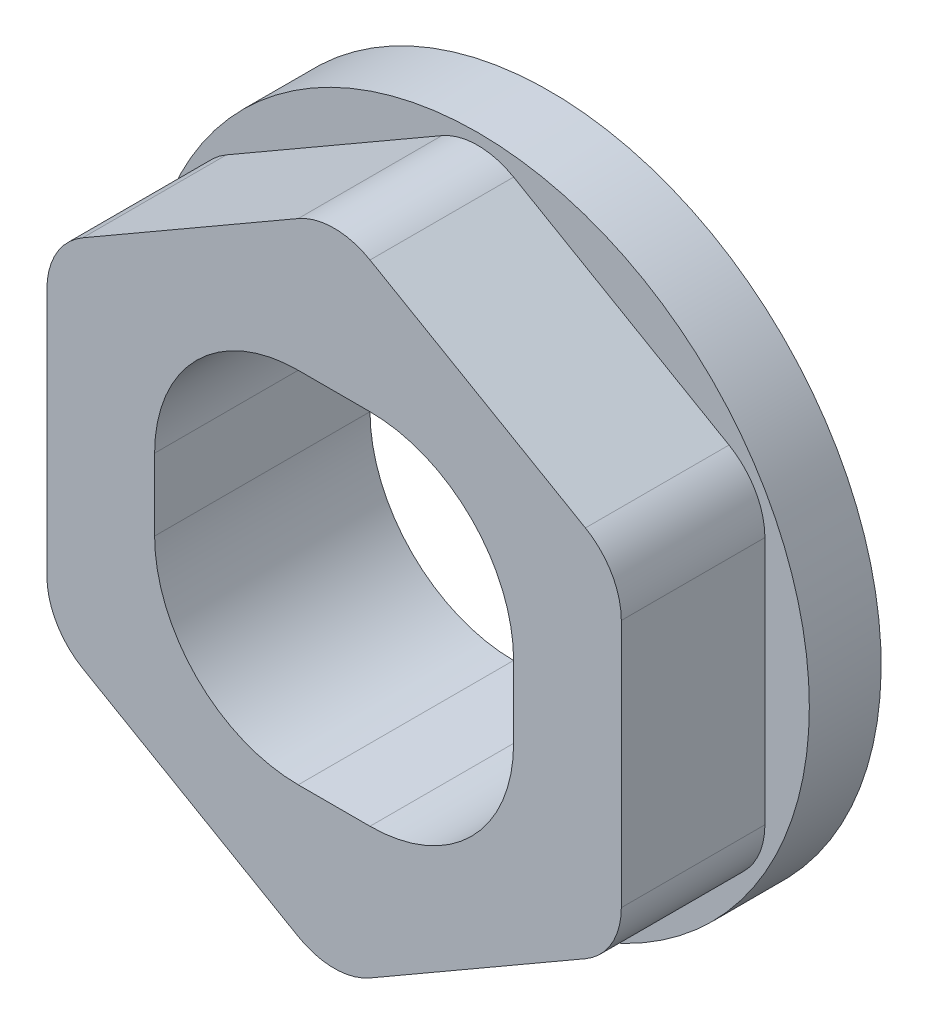
ISO-10303-21;
HEADER;
FILE_DESCRIPTION(('STEP AP214'),'2;1');
FILE_NAME('part.step','',(''),(''),'','','');
FILE_SCHEMA(('AUTOMOTIVE_DESIGN { 1 0 10303 214 1 1 1 1 }'));
ENDSEC;
DATA;
#1=APPLICATION_CONTEXT('core data for automotive mechanical design processes');
#2=APPLICATION_PROTOCOL_DEFINITION('international standard','automotive_design',2000,#1);
#3=PRODUCT_CONTEXT('',#1,'mechanical');
#4=PRODUCT('Part','Part','',(#3));
#5=PRODUCT_RELATED_PRODUCT_CATEGORY('part','',(#4));
#6=PRODUCT_DEFINITION_FORMATION('','',#4);
#7=PRODUCT_DEFINITION_CONTEXT('part definition',#1,'design');
#8=PRODUCT_DEFINITION('design','',#6,#7);
#9=PRODUCT_DEFINITION_SHAPE('','',#8);
#10=(LENGTH_UNIT() NAMED_UNIT(*) SI_UNIT(.MILLI.,.METRE.));
#11=(NAMED_UNIT(*) PLANE_ANGLE_UNIT() SI_UNIT($,.RADIAN.));
#12=(NAMED_UNIT(*) SI_UNIT($,.STERADIAN.) SOLID_ANGLE_UNIT());
#13=UNCERTAINTY_MEASURE_WITH_UNIT(LENGTH_MEASURE(1.E-05),#10,'distance_accuracy_value','');
#14=(GEOMETRIC_REPRESENTATION_CONTEXT(3) GLOBAL_UNCERTAINTY_ASSIGNED_CONTEXT((#13)) GLOBAL_UNIT_ASSIGNED_CONTEXT((#10,
#11,#12)) REPRESENTATION_CONTEXT('',''));
#15=CARTESIAN_POINT('',(0.,0.,0.));
#16=DIRECTION('',(0.,0.,1.));
#17=DIRECTION('',(1.,0.,0.));
#18=AXIS2_PLACEMENT_3D('',#15,#16,#17);
#19=CARTESIAN_POINT('',(0.,-12.5,10.));
#20=DIRECTION('',(0.,-1.,0.));
#21=DIRECTION('',(0.,0.,-1.));
#22=AXIS2_PLACEMENT_3D('',#19,#20,#21);
#23=PLANE('',#22);
#24=DIRECTION('',(0.,0.,-1.));
#25=VECTOR('',#24,1.);
#26=CARTESIAN_POINT('',(2.50000000000001,-12.5,10.));
#27=LINE('',#26,#25);
#28=CARTESIAN_POINT('',(2.50000000000001,-12.5,10.));
#29=VERTEX_POINT('',#28);
#30=CARTESIAN_POINT('',(2.50000000000001,-12.5,-5.));
#31=VERTEX_POINT('',#30);
#32=EDGE_CURVE('E281',#29,#31,#27,.T.);
#33=ORIENTED_EDGE('',*,*,#32,.T.);
#34=DIRECTION('',(-1.,0.,0.));
#35=VECTOR('',#34,1.);
#36=CARTESIAN_POINT('',(2.50000000000001,-12.5,-5.));
#37=LINE('',#36,#35);
#38=CARTESIAN_POINT('',(-2.5,-12.5,-5.));
#39=VERTEX_POINT('',#38);
#40=EDGE_CURVE('E220',#31,#39,#37,.T.);
#41=ORIENTED_EDGE('',*,*,#40,.T.);
#42=DIRECTION('',(0.,0.,-1.));
#43=VECTOR('',#42,1.);
#44=CARTESIAN_POINT('',(-2.5,-12.5,10.));
#45=LINE('',#44,#43);
#46=CARTESIAN_POINT('',(-2.5,-12.5,10.));
#47=VERTEX_POINT('',#46);
#48=EDGE_CURVE('E300',#47,#39,#45,.T.);
#49=ORIENTED_EDGE('',*,*,#48,.F.);
#50=DIRECTION('',(-1.,0.,0.));
#51=VECTOR('',#50,1.);
#52=CARTESIAN_POINT('',(0.,-12.5,10.));
#53=LINE('',#52,#51);
#54=EDGE_CURVE('E262',#29,#47,#53,.T.);
#55=ORIENTED_EDGE('',*,*,#54,.F.);
#56=EDGE_LOOP('',(#33,#41,#49,#55));
#57=FACE_BOUND('',#56,.T.);
#58=ADVANCED_FACE('F38',(#57),#23,.F.);
#59=CARTESIAN_POINT('',(-2.5,-2.5,10.));
#60=DIRECTION('',(0.,0.,-1.));
#61=DIRECTION('',(-1.,0.,0.));
#62=AXIS2_PLACEMENT_3D('',#59,#60,#61);
#63=CYLINDRICAL_SURFACE('',#62,10.);
#64=ORIENTED_EDGE('',*,*,#48,.T.);
#65=CARTESIAN_POINT('',(-2.5,-2.5,-5.));
#66=DIRECTION('',(0.,0.,-1.));
#67=DIRECTION('',(-1.,0.,0.));
#68=AXIS2_PLACEMENT_3D('',#65,#66,#67);
#69=CIRCLE('',#68,10.);
#70=CARTESIAN_POINT('',(-12.5,-2.5,-5.));
#71=VERTEX_POINT('',#70);
#72=EDGE_CURVE('E225',#39,#71,#69,.T.);
#73=ORIENTED_EDGE('',*,*,#72,.T.);
#74=DIRECTION('',(0.,0.,-1.));
#75=VECTOR('',#74,1.);
#76=CARTESIAN_POINT('',(-12.5,-2.5,10.));
#77=LINE('',#76,#75);
#78=CARTESIAN_POINT('',(-12.5,-2.5,10.));
#79=VERTEX_POINT('',#78);
#80=EDGE_CURVE('E298',#79,#71,#77,.T.);
#81=ORIENTED_EDGE('',*,*,#80,.F.);
#82=CARTESIAN_POINT('',(-2.5,-2.5,10.));
#83=DIRECTION('',(0.,0.,1.));
#84=DIRECTION('',(1.,0.,0.));
#85=AXIS2_PLACEMENT_3D('',#82,#83,#84);
#86=CIRCLE('',#85,10.);
#87=EDGE_CURVE('E265',#47,#79,#86,.F.);
#88=ORIENTED_EDGE('',*,*,#87,.F.);
#89=EDGE_LOOP('',(#64,#73,#81,#88));
#90=FACE_BOUND('',#89,.T.);
#91=ADVANCED_FACE('F416',(#90),#63,.F.);
#92=CARTESIAN_POINT('',(-12.5,0.,10.));
#93=DIRECTION('',(1.,0.,0.));
#94=DIRECTION('',(0.,0.,-1.));
#95=AXIS2_PLACEMENT_3D('',#92,#93,#94);
#96=PLANE('',#95);
#97=ORIENTED_EDGE('',*,*,#80,.T.);
#98=DIRECTION('',(0.,1.,0.));
#99=VECTOR('',#98,1.);
#100=CARTESIAN_POINT('',(-12.5,2.5,-5.));
#101=LINE('',#100,#99);
#102=CARTESIAN_POINT('',(-12.5,2.5,-5.));
#103=VERTEX_POINT('',#102);
#104=EDGE_CURVE('E228',#71,#103,#101,.T.);
#105=ORIENTED_EDGE('',*,*,#104,.T.);
#106=DIRECTION('',(0.,0.,-1.));
#107=VECTOR('',#106,1.);
#108=CARTESIAN_POINT('',(-12.5,2.5,10.));
#109=LINE('',#108,#107);
#110=CARTESIAN_POINT('',(-12.5,2.5,10.));
#111=VERTEX_POINT('',#110);
#112=EDGE_CURVE('E296',#111,#103,#109,.T.);
#113=ORIENTED_EDGE('',*,*,#112,.F.);
#114=DIRECTION('',(0.,-1.,0.));
#115=VECTOR('',#114,1.);
#116=CARTESIAN_POINT('',(-12.5,0.,10.));
#117=LINE('',#116,#115);
#118=EDGE_CURVE('E267',#111,#79,#117,.T.);
#119=ORIENTED_EDGE('',*,*,#118,.T.);
#120=EDGE_LOOP('',(#97,#105,#113,#119));
#121=FACE_BOUND('',#120,.T.);
#122=ADVANCED_FACE('F422',(#121),#96,.T.);
#123=CARTESIAN_POINT('',(-2.5,2.5,10.));
#124=DIRECTION('',(0.,0.,-1.));
#125=DIRECTION('',(-1.,0.,0.));
#126=AXIS2_PLACEMENT_3D('',#123,#124,#125);
#127=CYLINDRICAL_SURFACE('',#126,10.);
#128=ORIENTED_EDGE('',*,*,#112,.T.);
#129=CARTESIAN_POINT('',(-2.5,2.5,-5.));
#130=DIRECTION('',(0.,0.,-1.));
#131=DIRECTION('',(-1.,0.,0.));
#132=AXIS2_PLACEMENT_3D('',#129,#130,#131);
#133=CIRCLE('',#132,10.);
#134=CARTESIAN_POINT('',(-2.5,12.5,-5.));
#135=VERTEX_POINT('',#134);
#136=EDGE_CURVE('E231',#103,#135,#133,.T.);
#137=ORIENTED_EDGE('',*,*,#136,.T.);
#138=DIRECTION('',(0.,0.,-1.));
#139=VECTOR('',#138,1.);
#140=CARTESIAN_POINT('',(-2.5,12.5,10.));
#141=LINE('',#140,#139);
#142=CARTESIAN_POINT('',(-2.5,12.5,10.));
#143=VERTEX_POINT('',#142);
#144=EDGE_CURVE('E294',#143,#135,#141,.T.);
#145=ORIENTED_EDGE('',*,*,#144,.F.);
#146=CARTESIAN_POINT('',(-2.5,2.5,10.));
#147=DIRECTION('',(0.,0.,1.));
#148=DIRECTION('',(1.,0.,0.));
#149=AXIS2_PLACEMENT_3D('',#146,#147,#148);
#150=CIRCLE('',#149,10.);
#151=EDGE_CURVE('E270',#143,#111,#150,.T.);
#152=ORIENTED_EDGE('',*,*,#151,.T.);
#153=EDGE_LOOP('',(#128,#137,#145,#152));
#154=FACE_BOUND('',#153,.T.);
#155=ADVANCED_FACE('F578',(#154),#127,.F.);
#156=CARTESIAN_POINT('',(0.,12.5,10.));
#157=DIRECTION('',(0.,-1.,0.));
#158=DIRECTION('',(1.,0.,0.));
#159=AXIS2_PLACEMENT_3D('',#156,#157,#158);
#160=PLANE('',#159);
#161=ORIENTED_EDGE('',*,*,#144,.T.);
#162=DIRECTION('',(1.,0.,0.));
#163=VECTOR('',#162,1.);
#164=CARTESIAN_POINT('',(2.5,12.5,-5.));
#165=LINE('',#164,#163);
#166=CARTESIAN_POINT('',(2.5,12.5,-5.));
#167=VERTEX_POINT('',#166);
#168=EDGE_CURVE('E234',#135,#167,#165,.T.);
#169=ORIENTED_EDGE('',*,*,#168,.T.);
#170=DIRECTION('',(0.,0.,-1.));
#171=VECTOR('',#170,1.);
#172=CARTESIAN_POINT('',(2.5,12.5,10.));
#173=LINE('',#172,#171);
#174=CARTESIAN_POINT('',(2.5,12.5,10.));
#175=VERTEX_POINT('',#174);
#176=EDGE_CURVE('E205',#175,#167,#173,.T.);
#177=ORIENTED_EDGE('',*,*,#176,.F.);
#178=DIRECTION('',(-1.,0.,0.));
#179=VECTOR('',#178,1.);
#180=CARTESIAN_POINT('',(0.,12.5,10.));
#181=LINE('',#180,#179);
#182=EDGE_CURVE('E273',#175,#143,#181,.T.);
#183=ORIENTED_EDGE('',*,*,#182,.T.);
#184=EDGE_LOOP('',(#161,#169,#177,#183));
#185=FACE_BOUND('',#184,.T.);
#186=ADVANCED_FACE('F567',(#185),#160,.T.);
#187=CARTESIAN_POINT('',(2.50000000000001,2.5,10.));
#188=DIRECTION('',(0.,0.,-1.));
#189=DIRECTION('',(-1.,0.,0.));
#190=AXIS2_PLACEMENT_3D('',#187,#188,#189);
#191=CYLINDRICAL_SURFACE('',#190,10.);
#192=ORIENTED_EDGE('',*,*,#176,.T.);
#193=CARTESIAN_POINT('',(2.50000000000001,2.5,-5.));
#194=DIRECTION('',(0.,0.,-1.));
#195=DIRECTION('',(-1.,0.,0.));
#196=AXIS2_PLACEMENT_3D('',#193,#194,#195);
#197=CIRCLE('',#196,10.);
#198=CARTESIAN_POINT('',(12.5,2.50000000000001,-5.));
#199=VERTEX_POINT('',#198);
#200=EDGE_CURVE('E209',#167,#199,#197,.T.);
#201=ORIENTED_EDGE('',*,*,#200,.T.);
#202=DIRECTION('',(0.,0.,-1.));
#203=VECTOR('',#202,1.);
#204=CARTESIAN_POINT('',(12.5,2.50000000000001,10.));
#205=LINE('',#204,#203);
#206=CARTESIAN_POINT('',(12.5,2.50000000000001,10.));
#207=VERTEX_POINT('',#206);
#208=EDGE_CURVE('E195',#207,#199,#205,.T.);
#209=ORIENTED_EDGE('',*,*,#208,.F.);
#210=CARTESIAN_POINT('',(2.50000000000001,2.5,10.));
#211=DIRECTION('',(0.,0.,1.));
#212=DIRECTION('',(1.,0.,0.));
#213=AXIS2_PLACEMENT_3D('',#210,#211,#212);
#214=CIRCLE('',#213,10.);
#215=EDGE_CURVE('E276',#175,#207,#214,.F.);
#216=ORIENTED_EDGE('',*,*,#215,.F.);
#217=EDGE_LOOP('',(#192,#201,#209,#216));
#218=FACE_BOUND('',#217,.T.);
#219=ADVANCED_FACE('F210',(#218),#191,.F.);
#220=CARTESIAN_POINT('',(12.5,0.,10.));
#221=DIRECTION('',(1.,0.,0.));
#222=DIRECTION('',(0.,1.,0.));
#223=AXIS2_PLACEMENT_3D('',#220,#221,#222);
#224=PLANE('',#223);
#225=ORIENTED_EDGE('',*,*,#208,.T.);
#226=DIRECTION('',(0.,-1.,0.));
#227=VECTOR('',#226,1.);
#228=CARTESIAN_POINT('',(12.5,2.50000000000001,-5.));
#229=LINE('',#228,#227);
#230=CARTESIAN_POINT('',(12.5,-2.5,-5.));
#231=VERTEX_POINT('',#230);
#232=EDGE_CURVE('E200',#199,#231,#229,.T.);
#233=ORIENTED_EDGE('',*,*,#232,.T.);
#234=DIRECTION('',(0.,0.,-1.));
#235=VECTOR('',#234,1.);
#236=CARTESIAN_POINT('',(12.5,-2.5,10.));
#237=LINE('',#236,#235);
#238=CARTESIAN_POINT('',(12.5,-2.5,10.));
#239=VERTEX_POINT('',#238);
#240=EDGE_CURVE('E206',#239,#231,#237,.T.);
#241=ORIENTED_EDGE('',*,*,#240,.F.);
#242=DIRECTION('',(0.,-1.,0.));
#243=VECTOR('',#242,1.);
#244=CARTESIAN_POINT('',(12.5,0.,10.));
#245=LINE('',#244,#243);
#246=EDGE_CURVE('E202',#207,#239,#245,.T.);
#247=ORIENTED_EDGE('',*,*,#246,.F.);
#248=EDGE_LOOP('',(#225,#233,#241,#247));
#249=FACE_BOUND('',#248,.T.);
#250=ADVANCED_FACE('F197',(#249),#224,.F.);
#251=CARTESIAN_POINT('',(20.,0.,10.));
#252=DIRECTION('',(-1.,0.,0.));
#253=DIRECTION('',(0.,-1.,0.));
#254=AXIS2_PLACEMENT_3D('',#251,#252,#253);
#255=PLANE('',#254);
#256=DIRECTION('',(0.,1.,0.));
#257=VECTOR('',#256,1.);
#258=CARTESIAN_POINT('',(20.,0.,10.));
#259=LINE('',#258,#257);
#260=CARTESIAN_POINT('',(20.,-8.66025403784439,10.));
#261=VERTEX_POINT('',#260);
#262=CARTESIAN_POINT('',(20.,8.6602540378444,10.));
#263=VERTEX_POINT('',#262);
#264=EDGE_CURVE('E243',#261,#263,#259,.T.);
#265=ORIENTED_EDGE('',*,*,#264,.F.);
#266=DIRECTION('',(0.,0.,-1.));
#267=VECTOR('',#266,1.);
#268=CARTESIAN_POINT('',(20.,-8.66025403784439,10.));
#269=LINE('',#268,#267);
#270=CARTESIAN_POINT('',(20.,-8.66025403784439,0.));
#271=VERTEX_POINT('',#270);
#272=EDGE_CURVE('E336',#261,#271,#269,.T.);
#273=ORIENTED_EDGE('',*,*,#272,.T.);
#274=DIRECTION('',(0.,1.,0.));
#275=VECTOR('',#274,1.);
#276=CARTESIAN_POINT('',(20.,0.,0.));
#277=LINE('',#276,#275);
#278=CARTESIAN_POINT('',(20.,8.6602540378444,0.));
#279=VERTEX_POINT('',#278);
#280=EDGE_CURVE('E60',#271,#279,#277,.T.);
#281=ORIENTED_EDGE('',*,*,#280,.T.);
#282=DIRECTION('',(0.,0.,-1.));
#283=VECTOR('',#282,1.);
#284=CARTESIAN_POINT('',(20.,8.6602540378444,10.));
#285=LINE('',#284,#283);
#286=EDGE_CURVE('E334',#279,#263,#285,.F.);
#287=ORIENTED_EDGE('',*,*,#286,.T.);
#288=EDGE_LOOP('',(#265,#273,#281,#287));
#289=FACE_BOUND('',#288,.T.);
#290=ADVANCED_FACE('F361',(#289),#255,.F.);
#291=CARTESIAN_POINT('',(10.,17.3205080756888,10.));
#292=DIRECTION('',(-0.5,-0.866025403784439,0.));
#293=DIRECTION('',(0.866025403784439,-0.5,0.));
#294=AXIS2_PLACEMENT_3D('',#291,#292,#293);
#295=PLANE('',#294);
#296=DIRECTION('',(-0.866025403784439,0.5,0.));
#297=VECTOR('',#296,1.);
#298=CARTESIAN_POINT('',(10.,17.3205080756888,10.));
#299=LINE('',#298,#297);
#300=CARTESIAN_POINT('',(17.5,12.9903810567666,10.));
#301=VERTEX_POINT('',#300);
#302=CARTESIAN_POINT('',(2.49999999999999,21.650635094611,10.));
#303=VERTEX_POINT('',#302);
#304=EDGE_CURVE('E246',#301,#303,#299,.T.);
#305=ORIENTED_EDGE('',*,*,#304,.F.);
#306=DIRECTION('',(0.,0.,-1.));
#307=VECTOR('',#306,1.);
#308=CARTESIAN_POINT('',(17.5,12.9903810567666,10.));
#309=LINE('',#308,#307);
#310=CARTESIAN_POINT('',(17.5,12.9903810567666,0.));
#311=VERTEX_POINT('',#310);
#312=EDGE_CURVE('E340',#301,#311,#309,.T.);
#313=ORIENTED_EDGE('',*,*,#312,.T.);
#314=DIRECTION('',(-0.866025403784439,0.5,0.));
#315=VECTOR('',#314,1.);
#316=CARTESIAN_POINT('',(10.,17.3205080756888,0.));
#317=LINE('',#316,#315);
#318=CARTESIAN_POINT('',(2.49999999999999,21.650635094611,0.));
#319=VERTEX_POINT('',#318);
#320=EDGE_CURVE('E53',#311,#319,#317,.T.);
#321=ORIENTED_EDGE('',*,*,#320,.T.);
#322=DIRECTION('',(0.,0.,-1.));
#323=VECTOR('',#322,1.);
#324=CARTESIAN_POINT('',(2.5,21.650635094611,10.));
#325=LINE('',#324,#323);
#326=EDGE_CURVE('E338',#319,#303,#325,.F.);
#327=ORIENTED_EDGE('',*,*,#326,.T.);
#328=EDGE_LOOP('',(#305,#313,#321,#327));
#329=FACE_BOUND('',#328,.T.);
#330=ADVANCED_FACE('F406',(#329),#295,.F.);
#331=CARTESIAN_POINT('',(-10.,17.3205080756888,10.));
#332=DIRECTION('',(0.5,-0.866025403784439,0.));
#333=DIRECTION('',(0.866025403784439,0.5,0.));
#334=AXIS2_PLACEMENT_3D('',#331,#332,#333);
#335=PLANE('',#334);
#336=DIRECTION('',(-0.866025403784439,-0.5,0.));
#337=VECTOR('',#336,1.);
#338=CARTESIAN_POINT('',(-10.,17.3205080756888,0.));
#339=LINE('',#338,#337);
#340=CARTESIAN_POINT('',(-2.5,21.650635094611,0.));
#341=VERTEX_POINT('',#340);
#342=CARTESIAN_POINT('',(-17.5,12.9903810567666,0.));
#343=VERTEX_POINT('',#342);
#344=EDGE_CURVE('E284',#341,#343,#339,.T.);
#345=ORIENTED_EDGE('',*,*,#344,.T.);
#346=DIRECTION('',(0.,0.,-1.));
#347=VECTOR('',#346,1.);
#348=CARTESIAN_POINT('',(-17.5,12.9903810567666,10.));
#349=LINE('',#348,#347);
#350=CARTESIAN_POINT('',(-17.5,12.9903810567666,10.));
#351=VERTEX_POINT('',#350);
#352=EDGE_CURVE('E310',#343,#351,#349,.F.);
#353=ORIENTED_EDGE('',*,*,#352,.T.);
#354=DIRECTION('',(-0.866025403784439,-0.5,0.));
#355=VECTOR('',#354,1.);
#356=CARTESIAN_POINT('',(-10.,17.3205080756888,10.));
#357=LINE('',#356,#355);
#358=CARTESIAN_POINT('',(-2.5,21.650635094611,10.));
#359=VERTEX_POINT('',#358);
#360=EDGE_CURVE('E250',#359,#351,#357,.T.);
#361=ORIENTED_EDGE('',*,*,#360,.F.);
#362=DIRECTION('',(0.,0.,-1.));
#363=VECTOR('',#362,1.);
#364=CARTESIAN_POINT('',(-2.5,21.650635094611,10.));
#365=LINE('',#364,#363);
#366=EDGE_CURVE('E307',#359,#341,#365,.T.);
#367=ORIENTED_EDGE('',*,*,#366,.T.);
#368=EDGE_LOOP('',(#345,#353,#361,#367));
#369=FACE_BOUND('',#368,.T.);
#370=ADVANCED_FACE('F401',(#369),#335,.F.);
#371=CARTESIAN_POINT('',(-20.,0.,10.));
#372=DIRECTION('',(1.,0.,0.));
#373=DIRECTION('',(0.,0.,-1.));
#374=AXIS2_PLACEMENT_3D('',#371,#372,#373);
#375=PLANE('',#374);
#376=DIRECTION('',(0.,-1.,0.));
#377=VECTOR('',#376,1.);
#378=CARTESIAN_POINT('',(-20.,0.,10.));
#379=LINE('',#378,#377);
#380=CARTESIAN_POINT('',(-20.,8.66025403784439,10.));
#381=VERTEX_POINT('',#380);
#382=CARTESIAN_POINT('',(-20.,-8.66025403784439,10.));
#383=VERTEX_POINT('',#382);
#384=EDGE_CURVE('E253',#381,#383,#379,.T.);
#385=ORIENTED_EDGE('',*,*,#384,.F.);
#386=DIRECTION('',(0.,0.,-1.));
#387=VECTOR('',#386,1.);
#388=CARTESIAN_POINT('',(-20.,8.66025403784439,10.));
#389=LINE('',#388,#387);
#390=CARTESIAN_POINT('',(-20.,8.66025403784439,0.));
#391=VERTEX_POINT('',#390);
#392=EDGE_CURVE('E304',#381,#391,#389,.T.);
#393=ORIENTED_EDGE('',*,*,#392,.T.);
#394=DIRECTION('',(0.,-1.,0.));
#395=VECTOR('',#394,1.);
#396=CARTESIAN_POINT('',(-20.,0.,0.));
#397=LINE('',#396,#395);
#398=CARTESIAN_POINT('',(-20.,-8.66025403784439,0.));
#399=VERTEX_POINT('',#398);
#400=EDGE_CURVE('E286',#391,#399,#397,.T.);
#401=ORIENTED_EDGE('',*,*,#400,.T.);
#402=DIRECTION('',(0.,0.,-1.));
#403=VECTOR('',#402,1.);
#404=CARTESIAN_POINT('',(-20.,-8.66025403784439,10.));
#405=LINE('',#404,#403);
#406=EDGE_CURVE('E302',#399,#383,#405,.F.);
#407=ORIENTED_EDGE('',*,*,#406,.T.);
#408=EDGE_LOOP('',(#385,#393,#401,#407));
#409=FACE_BOUND('',#408,.T.);
#410=ADVANCED_FACE('F394',(#409),#375,.F.);
#411=CARTESIAN_POINT('',(-10.,-17.3205080756888,10.));
#412=DIRECTION('',(0.5,0.866025403784439,0.));
#413=DIRECTION('',(-0.866025403784439,0.5,0.));
#414=AXIS2_PLACEMENT_3D('',#411,#412,#413);
#415=PLANE('',#414);
#416=DIRECTION('',(0.866025403784439,-0.5,0.));
#417=VECTOR('',#416,1.);
#418=CARTESIAN_POINT('',(-10.,-17.3205080756888,10.));
#419=LINE('',#418,#417);
#420=CARTESIAN_POINT('',(-17.5,-12.9903810567666,10.));
#421=VERTEX_POINT('',#420);
#422=CARTESIAN_POINT('',(-2.50000000000001,-21.650635094611,10.));
#423=VERTEX_POINT('',#422);
#424=EDGE_CURVE('E256',#421,#423,#419,.T.);
#425=ORIENTED_EDGE('',*,*,#424,.F.);
#426=DIRECTION('',(0.,0.,-1.));
#427=VECTOR('',#426,1.);
#428=CARTESIAN_POINT('',(-17.5,-12.9903810567666,10.));
#429=LINE('',#428,#427);
#430=CARTESIAN_POINT('',(-17.5,-12.9903810567666,0.));
#431=VERTEX_POINT('',#430);
#432=EDGE_CURVE('E326',#421,#431,#429,.T.);
#433=ORIENTED_EDGE('',*,*,#432,.T.);
#434=DIRECTION('',(0.866025403784439,-0.5,0.));
#435=VECTOR('',#434,1.);
#436=CARTESIAN_POINT('',(-10.,-17.3205080756888,0.));
#437=LINE('',#436,#435);
#438=CARTESIAN_POINT('',(-2.50000000000001,-21.650635094611,0.));
#439=VERTEX_POINT('',#438);
#440=EDGE_CURVE('E288',#431,#439,#437,.T.);
#441=ORIENTED_EDGE('',*,*,#440,.T.);
#442=DIRECTION('',(0.,0.,-1.));
#443=VECTOR('',#442,1.);
#444=CARTESIAN_POINT('',(-2.50000000000001,-21.650635094611,10.));
#445=LINE('',#444,#443);
#446=EDGE_CURVE('E324',#439,#423,#445,.F.);
#447=ORIENTED_EDGE('',*,*,#446,.T.);
#448=EDGE_LOOP('',(#425,#433,#441,#447));
#449=FACE_BOUND('',#448,.T.);
#450=ADVANCED_FACE('F383',(#449),#415,.F.);
#451=CARTESIAN_POINT('',(9.99999999999999,-17.3205080756888,10.));
#452=DIRECTION('',(-0.5,0.866025403784439,0.));
#453=DIRECTION('',(-0.866025403784439,-0.5,0.));
#454=AXIS2_PLACEMENT_3D('',#451,#452,#453);
#455=PLANE('',#454);
#456=DIRECTION('',(0.866025403784439,0.5,0.));
#457=VECTOR('',#456,1.);
#458=CARTESIAN_POINT('',(9.99999999999999,-17.3205080756888,10.));
#459=LINE('',#458,#457);
#460=CARTESIAN_POINT('',(2.49999999999999,-21.650635094611,10.));
#461=VERTEX_POINT('',#460);
#462=CARTESIAN_POINT('',(17.5,-12.9903810567666,10.));
#463=VERTEX_POINT('',#462);
#464=EDGE_CURVE('E259',#461,#463,#459,.T.);
#465=ORIENTED_EDGE('',*,*,#464,.F.);
#466=DIRECTION('',(0.,0.,-1.));
#467=VECTOR('',#466,1.);
#468=CARTESIAN_POINT('',(2.49999999999999,-21.650635094611,10.));
#469=LINE('',#468,#467);
#470=CARTESIAN_POINT('',(2.49999999999999,-21.650635094611,0.));
#471=VERTEX_POINT('',#470);
#472=EDGE_CURVE('E331',#461,#471,#469,.T.);
#473=ORIENTED_EDGE('',*,*,#472,.T.);
#474=DIRECTION('',(0.866025403784439,0.5,0.));
#475=VECTOR('',#474,1.);
#476=CARTESIAN_POINT('',(9.99999999999999,-17.3205080756888,0.));
#477=LINE('',#476,#475);
#478=CARTESIAN_POINT('',(17.5,-12.9903810567666,0.));
#479=VERTEX_POINT('',#478);
#480=EDGE_CURVE('E247',#471,#479,#477,.T.);
#481=ORIENTED_EDGE('',*,*,#480,.T.);
#482=DIRECTION('',(0.,0.,-1.));
#483=VECTOR('',#482,1.);
#484=CARTESIAN_POINT('',(17.5,-12.9903810567666,10.));
#485=LINE('',#484,#483);
#486=EDGE_CURVE('E329',#479,#463,#485,.F.);
#487=ORIENTED_EDGE('',*,*,#486,.T.);
#488=EDGE_LOOP('',(#465,#473,#481,#487));
#489=FACE_BOUND('',#488,.T.);
#490=ADVANCED_FACE('F376',(#489),#455,.F.);
#491=CARTESIAN_POINT('',(2.50000000000001,-2.5,10.));
#492=DIRECTION('',(0.,0.,-1.));
#493=DIRECTION('',(-1.,0.,0.));
#494=AXIS2_PLACEMENT_3D('',#491,#492,#493);
#495=CYLINDRICAL_SURFACE('',#494,10.);
#496=ORIENTED_EDGE('',*,*,#240,.T.);
#497=CARTESIAN_POINT('',(2.50000000000001,-2.5,-5.));
#498=DIRECTION('',(0.,0.,-1.));
#499=DIRECTION('',(-1.,0.,0.));
#500=AXIS2_PLACEMENT_3D('',#497,#498,#499);
#501=CIRCLE('',#500,10.);
#502=EDGE_CURVE('E218',#231,#31,#501,.T.);
#503=ORIENTED_EDGE('',*,*,#502,.T.);
#504=ORIENTED_EDGE('',*,*,#32,.F.);
#505=CARTESIAN_POINT('',(2.50000000000001,-2.5,10.));
#506=DIRECTION('',(0.,0.,1.));
#507=DIRECTION('',(1.,0.,0.));
#508=AXIS2_PLACEMENT_3D('',#505,#506,#507);
#509=CIRCLE('',#508,10.);
#510=EDGE_CURVE('E279',#239,#29,#509,.F.);
#511=ORIENTED_EDGE('',*,*,#510,.F.);
#512=EDGE_LOOP('',(#496,#503,#504,#511));
#513=FACE_BOUND('',#512,.T.);
#514=ADVANCED_FACE('F429',(#513),#495,.F.);
#515=CARTESIAN_POINT('',(0.,0.,10.));
#516=DIRECTION('',(0.,0.,1.));
#517=DIRECTION('',(1.,0.,0.));
#518=AXIS2_PLACEMENT_3D('',#515,#516,#517);
#519=PLANE('',#518);
#520=ORIENTED_EDGE('',*,*,#360,.T.);
#521=CARTESIAN_POINT('',(-15.,8.66025403784439,10.));
#522=DIRECTION('',(0.,0.,1.));
#523=DIRECTION('',(1.,0.,0.));
#524=AXIS2_PLACEMENT_3D('',#521,#522,#523);
#525=CIRCLE('',#524,5.);
#526=EDGE_CURVE('E322',#351,#381,#525,.T.);
#527=ORIENTED_EDGE('',*,*,#526,.T.);
#528=ORIENTED_EDGE('',*,*,#384,.T.);
#529=CARTESIAN_POINT('',(-15.,-8.66025403784439,10.));
#530=DIRECTION('',(0.,0.,1.));
#531=DIRECTION('',(1.,0.,0.));
#532=AXIS2_PLACEMENT_3D('',#529,#530,#531);
#533=CIRCLE('',#532,5.);
#534=EDGE_CURVE('E320',#383,#421,#533,.T.);
#535=ORIENTED_EDGE('',*,*,#534,.T.);
#536=ORIENTED_EDGE('',*,*,#424,.T.);
#537=CARTESIAN_POINT('',(0.,-17.3205080756888,10.));
#538=DIRECTION('',(0.,0.,1.));
#539=DIRECTION('',(1.,0.,0.));
#540=AXIS2_PLACEMENT_3D('',#537,#538,#539);
#541=CIRCLE('',#540,5.);
#542=EDGE_CURVE('E318',#423,#461,#541,.T.);
#543=ORIENTED_EDGE('',*,*,#542,.T.);
#544=ORIENTED_EDGE('',*,*,#464,.T.);
#545=CARTESIAN_POINT('',(15.,-8.66025403784439,10.));
#546=DIRECTION('',(0.,0.,1.));
#547=DIRECTION('',(1.,0.,0.));
#548=AXIS2_PLACEMENT_3D('',#545,#546,#547);
#549=CIRCLE('',#548,5.);
#550=EDGE_CURVE('E316',#463,#261,#549,.T.);
#551=ORIENTED_EDGE('',*,*,#550,.T.);
#552=ORIENTED_EDGE('',*,*,#264,.T.);
#553=CARTESIAN_POINT('',(15.,8.6602540378444,10.));
#554=DIRECTION('',(0.,0.,1.));
#555=DIRECTION('',(1.,0.,0.));
#556=AXIS2_PLACEMENT_3D('',#553,#554,#555);
#557=CIRCLE('',#556,5.);
#558=EDGE_CURVE('E314',#263,#301,#557,.T.);
#559=ORIENTED_EDGE('',*,*,#558,.T.);
#560=ORIENTED_EDGE('',*,*,#304,.T.);
#561=CARTESIAN_POINT('',(0.,17.3205080756888,10.));
#562=DIRECTION('',(0.,0.,1.));
#563=DIRECTION('',(1.,0.,0.));
#564=AXIS2_PLACEMENT_3D('',#561,#562,#563);
#565=CIRCLE('',#564,5.);
#566=EDGE_CURVE('E312',#303,#359,#565,.T.);
#567=ORIENTED_EDGE('',*,*,#566,.T.);
#568=EDGE_LOOP('',(#520,#527,#528,#535,#536,#543,#544,#551,#552,#559,#560,#567));
#569=FACE_BOUND('',#568,.T.);
#570=ORIENTED_EDGE('',*,*,#54,.T.);
#571=ORIENTED_EDGE('',*,*,#87,.T.);
#572=ORIENTED_EDGE('',*,*,#118,.F.);
#573=ORIENTED_EDGE('',*,*,#151,.F.);
#574=ORIENTED_EDGE('',*,*,#182,.F.);
#575=ORIENTED_EDGE('',*,*,#215,.T.);
#576=ORIENTED_EDGE('',*,*,#246,.T.);
#577=ORIENTED_EDGE('',*,*,#510,.T.);
#578=EDGE_LOOP('',(#570,#571,#572,#573,#574,#575,#576,#577));
#579=FACE_BOUND('',#578,.T.);
#580=ADVANCED_FACE('F364',(#569,#579),#519,.T.);
#581=CARTESIAN_POINT('',(0.,0.,0.));
#582=DIRECTION('',(0.,0.,-1.));
#583=DIRECTION('',(-1.,0.,0.));
#584=AXIS2_PLACEMENT_3D('',#581,#582,#583);
#585=PLANE('',#584);
#586=CARTESIAN_POINT('',(0.,0.,0.));
#587=DIRECTION('',(0.,0.,-1.));
#588=DIRECTION('',(-1.,0.,0.));
#589=AXIS2_PLACEMENT_3D('',#586,#587,#588);
#590=CIRCLE('',#589,23.094010767585);
#591=CARTESIAN_POINT('',(0.,23.094010767585,0.));
#592=VERTEX_POINT('',#591);
#593=CARTESIAN_POINT('',(20.,11.5470053837925,0.));
#594=VERTEX_POINT('',#593);
#595=EDGE_CURVE('E242',#592,#594,#590,.T.);
#596=ORIENTED_EDGE('',*,*,#595,.F.);
#597=CARTESIAN_POINT('',(-20.,11.5470053837925,0.));
#598=VERTEX_POINT('',#597);
#599=EDGE_CURVE('E240',#598,#592,#590,.T.);
#600=ORIENTED_EDGE('',*,*,#599,.F.);
#601=CARTESIAN_POINT('',(-20.,-11.5470053837925,0.));
#602=VERTEX_POINT('',#601);
#603=EDGE_CURVE('E236',#602,#598,#590,.T.);
#604=ORIENTED_EDGE('',*,*,#603,.F.);
#605=CARTESIAN_POINT('',(0.,-23.094010767585,0.));
#606=VERTEX_POINT('',#605);
#607=EDGE_CURVE('E683',#606,#602,#590,.T.);
#608=ORIENTED_EDGE('',*,*,#607,.F.);
#609=CARTESIAN_POINT('',(20.,-11.5470053837925,0.));
#610=VERTEX_POINT('',#609);
#611=EDGE_CURVE('E681',#610,#606,#590,.T.);
#612=ORIENTED_EDGE('',*,*,#611,.F.);
#613=EDGE_CURVE('E680',#594,#610,#590,.T.);
#614=ORIENTED_EDGE('',*,*,#613,.F.);
#615=EDGE_LOOP('',(#596,#600,#604,#608,#612,#614));
#616=FACE_BOUND('',#615,.T.);
#617=ORIENTED_EDGE('',*,*,#320,.F.);
#618=CARTESIAN_POINT('',(15.,8.6602540378444,0.));
#619=DIRECTION('',(0.,0.,-1.));
#620=DIRECTION('',(-1.,0.,0.));
#621=AXIS2_PLACEMENT_3D('',#618,#619,#620);
#622=CIRCLE('',#621,5.);
#623=EDGE_CURVE('E46',#311,#279,#622,.T.);
#624=ORIENTED_EDGE('',*,*,#623,.T.);
#625=ORIENTED_EDGE('',*,*,#280,.F.);
#626=CARTESIAN_POINT('',(15.,-8.66025403784439,0.));
#627=DIRECTION('',(0.,0.,-1.));
#628=DIRECTION('',(-1.,0.,0.));
#629=AXIS2_PLACEMENT_3D('',#626,#627,#628);
#630=CIRCLE('',#629,5.);
#631=EDGE_CURVE('E351',#271,#479,#630,.T.);
#632=ORIENTED_EDGE('',*,*,#631,.T.);
#633=ORIENTED_EDGE('',*,*,#480,.F.);
#634=CARTESIAN_POINT('',(0.,-17.3205080756888,0.));
#635=DIRECTION('',(0.,0.,-1.));
#636=DIRECTION('',(-1.,0.,0.));
#637=AXIS2_PLACEMENT_3D('',#634,#635,#636);
#638=CIRCLE('',#637,5.);
#639=EDGE_CURVE('E348',#471,#439,#638,.T.);
#640=ORIENTED_EDGE('',*,*,#639,.T.);
#641=ORIENTED_EDGE('',*,*,#440,.F.);
#642=CARTESIAN_POINT('',(-15.,-8.66025403784439,0.));
#643=DIRECTION('',(0.,0.,-1.));
#644=DIRECTION('',(-1.,0.,0.));
#645=AXIS2_PLACEMENT_3D('',#642,#643,#644);
#646=CIRCLE('',#645,5.);
#647=EDGE_CURVE('E345',#431,#399,#646,.T.);
#648=ORIENTED_EDGE('',*,*,#647,.T.);
#649=ORIENTED_EDGE('',*,*,#400,.F.);
#650=CARTESIAN_POINT('',(-15.,8.66025403784439,0.));
#651=DIRECTION('',(0.,0.,-1.));
#652=DIRECTION('',(-1.,0.,0.));
#653=AXIS2_PLACEMENT_3D('',#650,#651,#652);
#654=CIRCLE('',#653,5.);
#655=EDGE_CURVE('E342',#391,#343,#654,.T.);
#656=ORIENTED_EDGE('',*,*,#655,.T.);
#657=ORIENTED_EDGE('',*,*,#344,.F.);
#658=CARTESIAN_POINT('',(0.,17.3205080756888,0.));
#659=DIRECTION('',(0.,0.,-1.));
#660=DIRECTION('',(-1.,0.,0.));
#661=AXIS2_PLACEMENT_3D('',#658,#659,#660);
#662=CIRCLE('',#661,5.);
#663=EDGE_CURVE('E11',#341,#319,#662,.T.);
#664=ORIENTED_EDGE('',*,*,#663,.T.);
#665=EDGE_LOOP('',(#617,#624,#625,#632,#633,#640,#641,#648,#649,#656,#657,#664));
#666=FACE_BOUND('',#665,.T.);
#667=ADVANCED_FACE('F355',(#616,#666),#585,.F.);
#668=CARTESIAN_POINT('',(0.,0.,-5.));
#669=DIRECTION('',(0.,0.,-1.));
#670=DIRECTION('',(-1.,0.,0.));
#671=AXIS2_PLACEMENT_3D('',#668,#669,#670);
#672=PLANE('',#671);
#673=CARTESIAN_POINT('',(0.,0.,-5.));
#674=DIRECTION('',(0.,0.,-1.));
#675=DIRECTION('',(-1.,0.,0.));
#676=AXIS2_PLACEMENT_3D('',#673,#674,#675);
#677=CIRCLE('',#676,23.094010767585);
#678=CARTESIAN_POINT('',(-23.094010767585,0.,-5.));
#679=VERTEX_POINT('',#678);
#680=EDGE_CURVE('E237',#679,#679,#677,.T.);
#681=ORIENTED_EDGE('',*,*,#680,.T.);
#682=EDGE_LOOP('',(#681));
#683=FACE_BOUND('',#682,.T.);
#684=ORIENTED_EDGE('',*,*,#232,.F.);
#685=ORIENTED_EDGE('',*,*,#200,.F.);
#686=ORIENTED_EDGE('',*,*,#168,.F.);
#687=ORIENTED_EDGE('',*,*,#136,.F.);
#688=ORIENTED_EDGE('',*,*,#104,.F.);
#689=ORIENTED_EDGE('',*,*,#72,.F.);
#690=ORIENTED_EDGE('',*,*,#40,.F.);
#691=ORIENTED_EDGE('',*,*,#502,.F.);
#692=EDGE_LOOP('',(#684,#685,#686,#687,#688,#689,#690,#691));
#693=FACE_BOUND('',#692,.T.);
#694=ADVANCED_FACE('F215',(#683,#693),#672,.T.);
#695=CARTESIAN_POINT('',(0.,0.,-5.));
#696=DIRECTION('',(0.,0.,1.));
#697=DIRECTION('',(1.,0.,0.));
#698=AXIS2_PLACEMENT_3D('',#695,#696,#697);
#699=CYLINDRICAL_SURFACE('',#698,23.094010767585);
#700=ORIENTED_EDGE('',*,*,#680,.F.);
#701=EDGE_LOOP('',(#700));
#702=FACE_BOUND('',#701,.T.);
#703=ORIENTED_EDGE('',*,*,#599,.T.);
#704=ORIENTED_EDGE('',*,*,#595,.T.);
#705=ORIENTED_EDGE('',*,*,#613,.T.);
#706=ORIENTED_EDGE('',*,*,#611,.T.);
#707=ORIENTED_EDGE('',*,*,#607,.T.);
#708=ORIENTED_EDGE('',*,*,#603,.T.);
#709=EDGE_LOOP('',(#703,#704,#705,#706,#707,#708));
#710=FACE_BOUND('',#709,.T.);
#711=ADVANCED_FACE('F472',(#702,#710),#699,.T.);
#712=CARTESIAN_POINT('',(-15.,8.66025403784439,10.));
#713=DIRECTION('',(0.,0.,-1.));
#714=DIRECTION('',(-1.,0.,0.));
#715=AXIS2_PLACEMENT_3D('',#712,#713,#714);
#716=CYLINDRICAL_SURFACE('',#715,5.);
#717=ORIENTED_EDGE('',*,*,#526,.F.);
#718=ORIENTED_EDGE('',*,*,#352,.F.);
#719=ORIENTED_EDGE('',*,*,#655,.F.);
#720=ORIENTED_EDGE('',*,*,#392,.F.);
#721=EDGE_LOOP('',(#717,#718,#719,#720));
#722=FACE_BOUND('',#721,.T.);
#723=ADVANCED_FACE('F398',(#722),#716,.T.);
#724=CARTESIAN_POINT('',(-15.,-8.66025403784439,10.));
#725=DIRECTION('',(0.,0.,-1.));
#726=DIRECTION('',(-1.,0.,0.));
#727=AXIS2_PLACEMENT_3D('',#724,#725,#726);
#728=CYLINDRICAL_SURFACE('',#727,5.);
#729=ORIENTED_EDGE('',*,*,#534,.F.);
#730=ORIENTED_EDGE('',*,*,#406,.F.);
#731=ORIENTED_EDGE('',*,*,#647,.F.);
#732=ORIENTED_EDGE('',*,*,#432,.F.);
#733=EDGE_LOOP('',(#729,#730,#731,#732));
#734=FACE_BOUND('',#733,.T.);
#735=ADVANCED_FACE('F389',(#734),#728,.T.);
#736=CARTESIAN_POINT('',(0.,-17.3205080756888,10.));
#737=DIRECTION('',(0.,0.,-1.));
#738=DIRECTION('',(-1.,0.,0.));
#739=AXIS2_PLACEMENT_3D('',#736,#737,#738);
#740=CYLINDRICAL_SURFACE('',#739,5.);
#741=ORIENTED_EDGE('',*,*,#542,.F.);
#742=ORIENTED_EDGE('',*,*,#446,.F.);
#743=ORIENTED_EDGE('',*,*,#639,.F.);
#744=ORIENTED_EDGE('',*,*,#472,.F.);
#745=EDGE_LOOP('',(#741,#742,#743,#744));
#746=FACE_BOUND('',#745,.T.);
#747=ADVANCED_FACE('F380',(#746),#740,.T.);
#748=CARTESIAN_POINT('',(15.,-8.66025403784439,10.));
#749=DIRECTION('',(0.,0.,-1.));
#750=DIRECTION('',(-1.,0.,0.));
#751=AXIS2_PLACEMENT_3D('',#748,#749,#750);
#752=CYLINDRICAL_SURFACE('',#751,5.);
#753=ORIENTED_EDGE('',*,*,#550,.F.);
#754=ORIENTED_EDGE('',*,*,#486,.F.);
#755=ORIENTED_EDGE('',*,*,#631,.F.);
#756=ORIENTED_EDGE('',*,*,#272,.F.);
#757=EDGE_LOOP('',(#753,#754,#755,#756));
#758=FACE_BOUND('',#757,.T.);
#759=ADVANCED_FACE('F371',(#758),#752,.T.);
#760=CARTESIAN_POINT('',(15.,8.6602540378444,10.));
#761=DIRECTION('',(0.,0.,-1.));
#762=DIRECTION('',(-1.,0.,0.));
#763=AXIS2_PLACEMENT_3D('',#760,#761,#762);
#764=CYLINDRICAL_SURFACE('',#763,5.);
#765=ORIENTED_EDGE('',*,*,#558,.F.);
#766=ORIENTED_EDGE('',*,*,#286,.F.);
#767=ORIENTED_EDGE('',*,*,#623,.F.);
#768=ORIENTED_EDGE('',*,*,#312,.F.);
#769=EDGE_LOOP('',(#765,#766,#767,#768));
#770=FACE_BOUND('',#769,.T.);
#771=ADVANCED_FACE('F359',(#770),#764,.T.);
#772=CARTESIAN_POINT('',(0.,17.3205080756888,10.));
#773=DIRECTION('',(0.,0.,-1.));
#774=DIRECTION('',(-1.,0.,0.));
#775=AXIS2_PLACEMENT_3D('',#772,#773,#774);
#776=CYLINDRICAL_SURFACE('',#775,5.);
#777=ORIENTED_EDGE('',*,*,#566,.F.);
#778=ORIENTED_EDGE('',*,*,#326,.F.);
#779=ORIENTED_EDGE('',*,*,#663,.F.);
#780=ORIENTED_EDGE('',*,*,#366,.F.);
#781=EDGE_LOOP('',(#777,#778,#779,#780));
#782=FACE_BOUND('',#781,.T.);
#783=ADVANCED_FACE('F40',(#782),#776,.T.);
#784=CLOSED_SHELL('',(#58,#91,#122,#155,#186,#219,#250,#290,#330,#370,#410,#450,#490,#514,#580,
#667,#694,#711,#723,#735,#747,#759,#771,#783));
#785=MANIFOLD_SOLID_BREP('B2',#784);
#786=ADVANCED_BREP_SHAPE_REPRESENTATION('',(#18,#785),#14);
#787=SHAPE_DEFINITION_REPRESENTATION(#9,#786);
ENDSEC;
END-ISO-10303-21;
